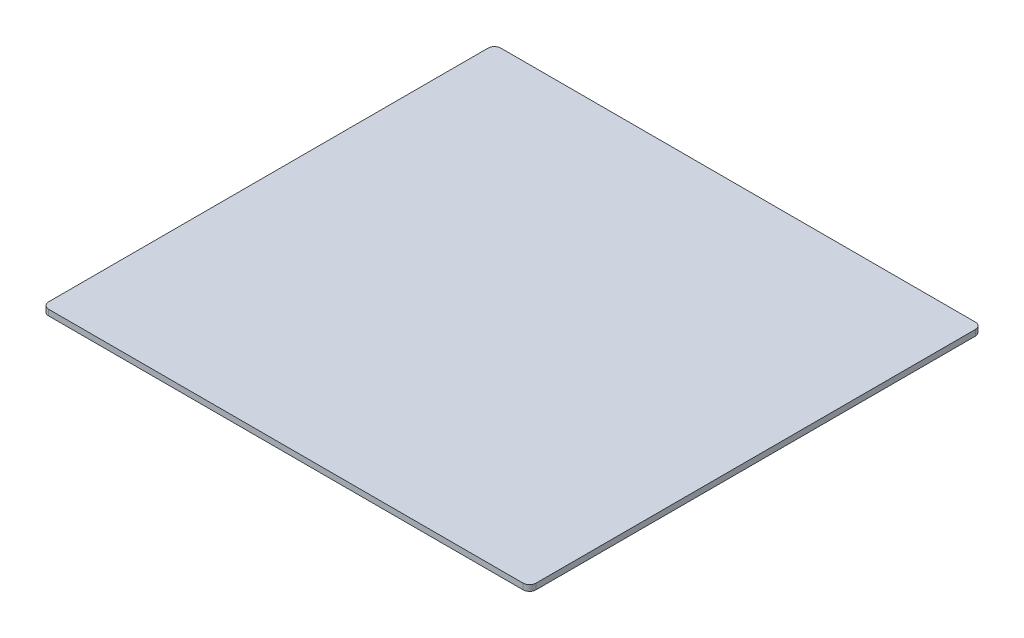
ISO-10303-21;
HEADER;
FILE_DESCRIPTION(('STEP AP214'),'2;1');
FILE_NAME('part.step','',(''),(''),'','','');
FILE_SCHEMA(('AUTOMOTIVE_DESIGN { 1 0 10303 214 1 1 1 1 }'));
ENDSEC;
DATA;
#1=APPLICATION_CONTEXT('core data for automotive mechanical design processes');
#2=APPLICATION_PROTOCOL_DEFINITION('international standard','automotive_design',2000,#1);
#3=PRODUCT_CONTEXT('',#1,'mechanical');
#4=PRODUCT('Part','Part','',(#3));
#5=PRODUCT_RELATED_PRODUCT_CATEGORY('part','',(#4));
#6=PRODUCT_DEFINITION_FORMATION('','',#4);
#7=PRODUCT_DEFINITION_CONTEXT('part definition',#1,'design');
#8=PRODUCT_DEFINITION('design','',#6,#7);
#9=PRODUCT_DEFINITION_SHAPE('','',#8);
#10=(LENGTH_UNIT() NAMED_UNIT(*) SI_UNIT(.MILLI.,.METRE.));
#11=(NAMED_UNIT(*) PLANE_ANGLE_UNIT() SI_UNIT($,.RADIAN.));
#12=(NAMED_UNIT(*) SI_UNIT($,.STERADIAN.) SOLID_ANGLE_UNIT());
#13=UNCERTAINTY_MEASURE_WITH_UNIT(LENGTH_MEASURE(1.E-05),#10,'distance_accuracy_value','');
#14=(GEOMETRIC_REPRESENTATION_CONTEXT(3) GLOBAL_UNCERTAINTY_ASSIGNED_CONTEXT((#13)) GLOBAL_UNIT_ASSIGNED_CONTEXT((#10,
#11,#12)) REPRESENTATION_CONTEXT('',''));
#15=CARTESIAN_POINT('',(0.,0.,0.));
#16=DIRECTION('',(0.,0.,1.));
#17=DIRECTION('',(1.,0.,0.));
#18=AXIS2_PLACEMENT_3D('',#15,#16,#17);
#19=CARTESIAN_POINT('',(0.,23.2,0.));
#20=DIRECTION('',(0.,-1.,0.));
#21=DIRECTION('',(0.,0.,-1.));
#22=AXIS2_PLACEMENT_3D('',#19,#20,#21);
#23=PLANE('',#22);
#24=DIRECTION('',(0.,0.,1.));
#25=VECTOR('',#24,1.);
#26=CARTESIAN_POINT('',(380.,23.2,-352.65));
#27=LINE('',#26,#25);
#28=CARTESIAN_POINT('',(380.,23.2,-342.65));
#29=VERTEX_POINT('',#28);
#30=CARTESIAN_POINT('',(380.,23.2,342.65));
#31=VERTEX_POINT('',#30);
#32=EDGE_CURVE('E464',#29,#31,#27,.T.);
#33=ORIENTED_EDGE('',*,*,#32,.F.);
#34=CARTESIAN_POINT('',(370.,23.2,-342.65));
#35=DIRECTION('',(0.,-1.,0.));
#36=DIRECTION('',(0.,0.,-1.));
#37=AXIS2_PLACEMENT_3D('',#34,#35,#36);
#38=CIRCLE('',#37,10.);
#39=CARTESIAN_POINT('',(370.,23.2,-352.65));
#40=VERTEX_POINT('',#39);
#41=EDGE_CURVE('E577',#29,#40,#38,.F.);
#42=ORIENTED_EDGE('',*,*,#41,.T.);
#43=DIRECTION('',(1.,0.,0.));
#44=VECTOR('',#43,1.);
#45=CARTESIAN_POINT('',(-380.,23.2,-352.65));
#46=LINE('',#45,#44);
#47=CARTESIAN_POINT('',(-370.,23.2,-352.65));
#48=VERTEX_POINT('',#47);
#49=EDGE_CURVE('E460',#48,#40,#46,.T.);
#50=ORIENTED_EDGE('',*,*,#49,.F.);
#51=CARTESIAN_POINT('',(-370.,23.2,-342.65));
#52=DIRECTION('',(0.,-1.,0.));
#53=DIRECTION('',(0.,0.,-1.));
#54=AXIS2_PLACEMENT_3D('',#51,#52,#53);
#55=CIRCLE('',#54,10.);
#56=CARTESIAN_POINT('',(-380.,23.2,-342.65));
#57=VERTEX_POINT('',#56);
#58=EDGE_CURVE('E568',#48,#57,#55,.F.);
#59=ORIENTED_EDGE('',*,*,#58,.T.);
#60=DIRECTION('',(0.,0.,1.));
#61=VECTOR('',#60,1.);
#62=CARTESIAN_POINT('',(-380.,23.2,-352.65));
#63=LINE('',#62,#61);
#64=CARTESIAN_POINT('',(-380.,23.2,342.65));
#65=VERTEX_POINT('',#64);
#66=EDGE_CURVE('E472',#57,#65,#63,.T.);
#67=ORIENTED_EDGE('',*,*,#66,.T.);
#68=CARTESIAN_POINT('',(-370.,23.2,342.65));
#69=DIRECTION('',(0.,-1.,0.));
#70=DIRECTION('',(0.,0.,-1.));
#71=AXIS2_PLACEMENT_3D('',#68,#69,#70);
#72=CIRCLE('',#71,10.);
#73=CARTESIAN_POINT('',(-370.,23.2,352.65));
#74=VERTEX_POINT('',#73);
#75=EDGE_CURVE('E571',#65,#74,#72,.F.);
#76=ORIENTED_EDGE('',*,*,#75,.T.);
#77=DIRECTION('',(1.,0.,0.));
#78=VECTOR('',#77,1.);
#79=CARTESIAN_POINT('',(-380.,23.2,352.65));
#80=LINE('',#79,#78);
#81=CARTESIAN_POINT('',(370.,23.2,352.65));
#82=VERTEX_POINT('',#81);
#83=EDGE_CURVE('E468',#74,#82,#80,.T.);
#84=ORIENTED_EDGE('',*,*,#83,.T.);
#85=CARTESIAN_POINT('',(370.,23.2,342.65));
#86=DIRECTION('',(0.,-1.,0.));
#87=DIRECTION('',(0.,0.,-1.));
#88=AXIS2_PLACEMENT_3D('',#85,#86,#87);
#89=CIRCLE('',#88,10.);
#90=EDGE_CURVE('E574',#82,#31,#89,.F.);
#91=ORIENTED_EDGE('',*,*,#90,.T.);
#92=EDGE_LOOP('',(#33,#42,#50,#59,#67,#76,#84,#91));
#93=FACE_BOUND('',#92,.T.);
#94=ADVANCED_FACE('F42',(#93),#23,.F.);
#95=CARTESIAN_POINT('',(-380.,23.2,-352.65));
#96=DIRECTION('',(0.,0.,-1.));
#97=DIRECTION('',(-1.,0.,0.));
#98=AXIS2_PLACEMENT_3D('',#95,#96,#97);
#99=PLANE('',#98);
#100=DIRECTION('',(0.,-1.,0.));
#101=VECTOR('',#100,1.);
#102=CARTESIAN_POINT('',(370.,23.2,-352.65));
#103=LINE('',#102,#101);
#104=CARTESIAN_POINT('',(370.,14.1,-352.65));
#105=VERTEX_POINT('',#104);
#106=EDGE_CURVE('E547',#40,#105,#103,.T.);
#107=ORIENTED_EDGE('',*,*,#106,.T.);
#108=DIRECTION('',(1.,0.,0.));
#109=VECTOR('',#108,1.);
#110=CARTESIAN_POINT('',(-380.,14.1,-352.65));
#111=LINE('',#110,#109);
#112=CARTESIAN_POINT('',(-370.,14.1,-352.65));
#113=VERTEX_POINT('',#112);
#114=EDGE_CURVE('E448',#113,#105,#111,.T.);
#115=ORIENTED_EDGE('',*,*,#114,.F.);
#116=DIRECTION('',(0.,-1.,0.));
#117=VECTOR('',#116,1.);
#118=CARTESIAN_POINT('',(-370.,23.2,-352.65));
#119=LINE('',#118,#117);
#120=EDGE_CURVE('E544',#113,#48,#119,.F.);
#121=ORIENTED_EDGE('',*,*,#120,.T.);
#122=ORIENTED_EDGE('',*,*,#49,.T.);
#123=EDGE_LOOP('',(#107,#115,#121,#122));
#124=FACE_BOUND('',#123,.T.);
#125=ADVANCED_FACE('F625',(#124),#99,.T.);
#126=CARTESIAN_POINT('',(-380.,23.2,-352.65));
#127=DIRECTION('',(1.,0.,0.));
#128=DIRECTION('',(0.,0.,-1.));
#129=AXIS2_PLACEMENT_3D('',#126,#127,#128);
#130=PLANE('',#129);
#131=DIRECTION('',(0.,-1.,0.));
#132=VECTOR('',#131,1.);
#133=CARTESIAN_POINT('',(-380.,14.1,-342.65));
#134=LINE('',#133,#132);
#135=CARTESIAN_POINT('',(-380.,14.1,-342.65));
#136=VERTEX_POINT('',#135);
#137=EDGE_CURVE('E586',#57,#136,#134,.T.);
#138=ORIENTED_EDGE('',*,*,#137,.T.);
#139=DIRECTION('',(0.,0.,-1.));
#140=VECTOR('',#139,1.);
#141=CARTESIAN_POINT('',(-380.,14.1,-352.65));
#142=LINE('',#141,#140);
#143=CARTESIAN_POINT('',(-380.,14.1,342.65));
#144=VERTEX_POINT('',#143);
#145=EDGE_CURVE('E444',#144,#136,#142,.T.);
#146=ORIENTED_EDGE('',*,*,#145,.F.);
#147=DIRECTION('',(0.,-1.,0.));
#148=VECTOR('',#147,1.);
#149=CARTESIAN_POINT('',(-380.,23.2,342.65));
#150=LINE('',#149,#148);
#151=EDGE_CURVE('E52',#144,#65,#150,.F.);
#152=ORIENTED_EDGE('',*,*,#151,.T.);
#153=ORIENTED_EDGE('',*,*,#66,.F.);
#154=EDGE_LOOP('',(#138,#146,#152,#153));
#155=FACE_BOUND('',#154,.T.);
#156=ADVANCED_FACE('F593',(#155),#130,.F.);
#157=CARTESIAN_POINT('',(-380.,23.2,352.65));
#158=DIRECTION('',(0.,0.,-1.));
#159=DIRECTION('',(-1.,0.,0.));
#160=AXIS2_PLACEMENT_3D('',#157,#158,#159);
#161=PLANE('',#160);
#162=DIRECTION('',(0.,-1.,0.));
#163=VECTOR('',#162,1.);
#164=CARTESIAN_POINT('',(-370.,23.2,352.65));
#165=LINE('',#164,#163);
#166=CARTESIAN_POINT('',(-370.,14.1,352.65));
#167=VERTEX_POINT('',#166);
#168=EDGE_CURVE('E580',#74,#167,#165,.T.);
#169=ORIENTED_EDGE('',*,*,#168,.T.);
#170=DIRECTION('',(-1.,0.,0.));
#171=VECTOR('',#170,1.);
#172=CARTESIAN_POINT('',(-380.,14.1,352.65));
#173=LINE('',#172,#171);
#174=CARTESIAN_POINT('',(370.,14.1,352.65));
#175=VERTEX_POINT('',#174);
#176=EDGE_CURVE('E456',#175,#167,#173,.T.);
#177=ORIENTED_EDGE('',*,*,#176,.F.);
#178=DIRECTION('',(0.,-1.,0.));
#179=VECTOR('',#178,1.);
#180=CARTESIAN_POINT('',(370.,23.2,352.65));
#181=LINE('',#180,#179);
#182=EDGE_CURVE('E583',#175,#82,#181,.F.);
#183=ORIENTED_EDGE('',*,*,#182,.T.);
#184=ORIENTED_EDGE('',*,*,#83,.F.);
#185=EDGE_LOOP('',(#169,#177,#183,#184));
#186=FACE_BOUND('',#185,.T.);
#187=ADVANCED_FACE('F607',(#186),#161,.F.);
#188=CARTESIAN_POINT('',(380.,23.2,-352.65));
#189=DIRECTION('',(1.,0.,0.));
#190=DIRECTION('',(0.,0.,-1.));
#191=AXIS2_PLACEMENT_3D('',#188,#189,#190);
#192=PLANE('',#191);
#193=DIRECTION('',(0.,-1.,0.));
#194=VECTOR('',#193,1.);
#195=CARTESIAN_POINT('',(380.,14.1,342.65));
#196=LINE('',#195,#194);
#197=CARTESIAN_POINT('',(380.,14.1,342.65));
#198=VERTEX_POINT('',#197);
#199=EDGE_CURVE('E562',#31,#198,#196,.T.);
#200=ORIENTED_EDGE('',*,*,#199,.T.);
#201=DIRECTION('',(0.,0.,1.));
#202=VECTOR('',#201,1.);
#203=CARTESIAN_POINT('',(380.,14.1,-352.65));
#204=LINE('',#203,#202);
#205=CARTESIAN_POINT('',(380.,14.1,-342.65));
#206=VERTEX_POINT('',#205);
#207=EDGE_CURVE('E452',#206,#198,#204,.T.);
#208=ORIENTED_EDGE('',*,*,#207,.F.);
#209=DIRECTION('',(0.,-1.,0.));
#210=VECTOR('',#209,1.);
#211=CARTESIAN_POINT('',(380.,23.2,-342.65));
#212=LINE('',#211,#210);
#213=EDGE_CURVE('E565',#206,#29,#212,.F.);
#214=ORIENTED_EDGE('',*,*,#213,.T.);
#215=ORIENTED_EDGE('',*,*,#32,.T.);
#216=EDGE_LOOP('',(#200,#208,#214,#215));
#217=FACE_BOUND('',#216,.T.);
#218=ADVANCED_FACE('F616',(#217),#192,.T.);
#219=CARTESIAN_POINT('',(0.,14.1,0.));
#220=DIRECTION('',(0.,1.,0.));
#221=DIRECTION('',(0.,0.,1.));
#222=AXIS2_PLACEMENT_3D('',#219,#220,#221);
#223=PLANE('',#222);
#224=DIRECTION('',(-1.,0.,0.));
#225=VECTOR('',#224,1.);
#226=CARTESIAN_POINT('',(0.,14.1,-315.75));
#227=LINE('',#226,#225);
#228=CARTESIAN_POINT('',(223.177282085676,14.1,-315.75));
#229=VERTEX_POINT('',#228);
#230=CARTESIAN_POINT('',(-223.177282085676,14.1,-315.75));
#231=VERTEX_POINT('',#230);
#232=EDGE_CURVE('E480',#229,#231,#227,.T.);
#233=ORIENTED_EDGE('',*,*,#232,.T.);
#234=CARTESIAN_POINT('',(-218.627660484725,14.1,-300.277660484725));
#235=DIRECTION('',(0.,1.,0.));
#236=DIRECTION('',(0.707106781186549,0.,0.707106781186546));
#237=AXIS2_PLACEMENT_3D('',#234,#235,#236);
#238=ELLIPSE('',#237,17.6007551017536,13.);
#239=CARTESIAN_POINT('',(-234.1,14.1,-304.827282085676));
#240=VERTEX_POINT('',#239);
#241=EDGE_CURVE('E532',#231,#240,#238,.T.);
#242=ORIENTED_EDGE('',*,*,#241,.T.);
#243=DIRECTION('',(0.,0.,1.));
#244=VECTOR('',#243,1.);
#245=CARTESIAN_POINT('',(-234.1,14.1,0.));
#246=LINE('',#245,#244);
#247=CARTESIAN_POINT('',(-234.1,14.1,304.827282085676));
#248=VERTEX_POINT('',#247);
#249=EDGE_CURVE('E476',#240,#248,#246,.T.);
#250=ORIENTED_EDGE('',*,*,#249,.T.);
#251=CARTESIAN_POINT('',(-218.627660484725,14.1,300.277660484725));
#252=DIRECTION('',(0.,1.,0.));
#253=DIRECTION('',(0.707106781186549,0.,-0.707106781186546));
#254=AXIS2_PLACEMENT_3D('',#251,#252,#253);
#255=ELLIPSE('',#254,17.6007551017536,13.);
#256=CARTESIAN_POINT('',(-223.177282085676,14.1,315.75));
#257=VERTEX_POINT('',#256);
#258=EDGE_CURVE('E535',#248,#257,#255,.T.);
#259=ORIENTED_EDGE('',*,*,#258,.T.);
#260=DIRECTION('',(1.,0.,0.));
#261=VECTOR('',#260,1.);
#262=CARTESIAN_POINT('',(0.,14.1,315.75));
#263=LINE('',#262,#261);
#264=CARTESIAN_POINT('',(223.177282085676,14.1,315.75));
#265=VERTEX_POINT('',#264);
#266=EDGE_CURVE('E488',#257,#265,#263,.T.);
#267=ORIENTED_EDGE('',*,*,#266,.T.);
#268=CARTESIAN_POINT('',(218.627660484725,14.1,300.277660484725));
#269=DIRECTION('',(0.,1.,0.));
#270=DIRECTION('',(0.707106781186548,0.,0.707106781186548));
#271=AXIS2_PLACEMENT_3D('',#268,#269,#270);
#272=ELLIPSE('',#271,17.6007551017536,13.);
#273=CARTESIAN_POINT('',(234.1,14.1,304.827282085676));
#274=VERTEX_POINT('',#273);
#275=EDGE_CURVE('E538',#265,#274,#272,.T.);
#276=ORIENTED_EDGE('',*,*,#275,.T.);
#277=DIRECTION('',(0.,0.,-1.));
#278=VECTOR('',#277,1.);
#279=CARTESIAN_POINT('',(234.1,14.1,0.));
#280=LINE('',#279,#278);
#281=CARTESIAN_POINT('',(234.1,14.1,-304.827282085676));
#282=VERTEX_POINT('',#281);
#283=EDGE_CURVE('E484',#274,#282,#280,.T.);
#284=ORIENTED_EDGE('',*,*,#283,.T.);
#285=CARTESIAN_POINT('',(218.627660484725,14.1,-300.277660484725));
#286=DIRECTION('',(0.,1.,0.));
#287=DIRECTION('',(0.707106781186548,0.,-0.707106781186548));
#288=AXIS2_PLACEMENT_3D('',#285,#286,#287);
#289=ELLIPSE('',#288,17.6007551017536,13.);
#290=EDGE_CURVE('E541',#282,#229,#289,.T.);
#291=ORIENTED_EDGE('',*,*,#290,.T.);
#292=EDGE_LOOP('',(#233,#242,#250,#259,#267,#276,#284,#291));
#293=FACE_BOUND('',#292,.T.);
#294=ORIENTED_EDGE('',*,*,#114,.T.);
#295=CARTESIAN_POINT('',(370.,14.1,-342.65));
#296=DIRECTION('',(0.,1.,0.));
#297=DIRECTION('',(0.,0.,1.));
#298=AXIS2_PLACEMENT_3D('',#295,#296,#297);
#299=CIRCLE('',#298,10.);
#300=EDGE_CURVE('E559',#105,#206,#299,.F.);
#301=ORIENTED_EDGE('',*,*,#300,.T.);
#302=ORIENTED_EDGE('',*,*,#207,.T.);
#303=CARTESIAN_POINT('',(370.,14.1,342.65));
#304=DIRECTION('',(0.,1.,0.));
#305=DIRECTION('',(0.,0.,1.));
#306=AXIS2_PLACEMENT_3D('',#303,#304,#305);
#307=CIRCLE('',#306,10.);
#308=EDGE_CURVE('E556',#198,#175,#307,.F.);
#309=ORIENTED_EDGE('',*,*,#308,.T.);
#310=ORIENTED_EDGE('',*,*,#176,.T.);
#311=CARTESIAN_POINT('',(-370.,14.1,342.65));
#312=DIRECTION('',(0.,1.,0.));
#313=DIRECTION('',(0.,0.,1.));
#314=AXIS2_PLACEMENT_3D('',#311,#312,#313);
#315=CIRCLE('',#314,10.);
#316=EDGE_CURVE('E553',#167,#144,#315,.F.);
#317=ORIENTED_EDGE('',*,*,#316,.T.);
#318=ORIENTED_EDGE('',*,*,#145,.T.);
#319=CARTESIAN_POINT('',(-370.,14.1,-342.65));
#320=DIRECTION('',(0.,1.,0.));
#321=DIRECTION('',(0.,0.,1.));
#322=AXIS2_PLACEMENT_3D('',#319,#320,#321);
#323=CIRCLE('',#322,10.);
#324=EDGE_CURVE('E550',#136,#113,#323,.F.);
#325=ORIENTED_EDGE('',*,*,#324,.T.);
#326=EDGE_LOOP('',(#294,#301,#302,#309,#310,#317,#318,#325));
#327=FACE_BOUND('',#326,.T.);
#328=ADVANCED_FACE('F630',(#293,#327),#223,.F.);
#329=CARTESIAN_POINT('',(0.,0.,0.));
#330=DIRECTION('',(0.,-1.,0.));
#331=DIRECTION('',(0.,0.,-1.));
#332=AXIS2_PLACEMENT_3D('',#329,#330,#331);
#333=PLANE('',#332);
#334=DIRECTION('',(0.,0.,-1.));
#335=VECTOR('',#334,1.);
#336=CARTESIAN_POINT('',(-225.,0.,306.65));
#337=LINE('',#336,#335);
#338=CARTESIAN_POINT('',(-225.,0.,295.727282085676));
#339=VERTEX_POINT('',#338);
#340=CARTESIAN_POINT('',(-225.,0.,-295.727282085676));
#341=VERTEX_POINT('',#340);
#342=EDGE_CURVE('E361',#339,#341,#337,.T.);
#343=ORIENTED_EDGE('',*,*,#342,.T.);
#344=CARTESIAN_POINT('',(-209.527660484725,0.,-291.177660484725));
#345=DIRECTION('',(0.,-1.,0.));
#346=DIRECTION('',(0.707106781186549,0.,0.707106781186546));
#347=AXIS2_PLACEMENT_3D('',#344,#345,#346);
#348=ELLIPSE('',#347,17.6007551017536,13.);
#349=CARTESIAN_POINT('',(-214.077282085676,0.,-306.65));
#350=VERTEX_POINT('',#349);
#351=EDGE_CURVE('E508',#341,#350,#348,.T.);
#352=ORIENTED_EDGE('',*,*,#351,.T.);
#353=DIRECTION('',(1.,0.,0.));
#354=VECTOR('',#353,1.);
#355=CARTESIAN_POINT('',(-225.,0.,-306.65));
#356=LINE('',#355,#354);
#357=CARTESIAN_POINT('',(214.077282085676,0.,-306.65));
#358=VERTEX_POINT('',#357);
#359=EDGE_CURVE('E432',#350,#358,#356,.T.);
#360=ORIENTED_EDGE('',*,*,#359,.T.);
#361=CARTESIAN_POINT('',(209.527660484725,0.,-291.177660484725));
#362=DIRECTION('',(0.,-1.,0.));
#363=DIRECTION('',(0.707106781186548,0.,-0.707106781186548));
#364=AXIS2_PLACEMENT_3D('',#361,#362,#363);
#365=ELLIPSE('',#364,17.6007551017536,13.);
#366=CARTESIAN_POINT('',(225.,0.,-295.727282085676));
#367=VERTEX_POINT('',#366);
#368=EDGE_CURVE('E499',#358,#367,#365,.T.);
#369=ORIENTED_EDGE('',*,*,#368,.T.);
#370=DIRECTION('',(0.,0.,1.));
#371=VECTOR('',#370,1.);
#372=CARTESIAN_POINT('',(225.,0.,306.65));
#373=LINE('',#372,#371);
#374=CARTESIAN_POINT('',(225.,0.,295.727282085676));
#375=VERTEX_POINT('',#374);
#376=EDGE_CURVE('E436',#367,#375,#373,.T.);
#377=ORIENTED_EDGE('',*,*,#376,.T.);
#378=CARTESIAN_POINT('',(209.527660484725,0.,291.177660484725));
#379=DIRECTION('',(0.,-1.,0.));
#380=DIRECTION('',(0.707106781186548,0.,0.707106781186548));
#381=AXIS2_PLACEMENT_3D('',#378,#379,#380);
#382=ELLIPSE('',#381,17.6007551017536,13.);
#383=CARTESIAN_POINT('',(214.077282085676,0.,306.65));
#384=VERTEX_POINT('',#383);
#385=EDGE_CURVE('E502',#375,#384,#382,.T.);
#386=ORIENTED_EDGE('',*,*,#385,.T.);
#387=DIRECTION('',(-1.,0.,0.));
#388=VECTOR('',#387,1.);
#389=CARTESIAN_POINT('',(-225.,0.,306.65));
#390=LINE('',#389,#388);
#391=CARTESIAN_POINT('',(-214.077282085676,0.,306.65));
#392=VERTEX_POINT('',#391);
#393=EDGE_CURVE('E440',#384,#392,#390,.T.);
#394=ORIENTED_EDGE('',*,*,#393,.T.);
#395=CARTESIAN_POINT('',(-209.527660484725,0.,291.177660484725));
#396=DIRECTION('',(0.,-1.,0.));
#397=DIRECTION('',(0.707106781186549,0.,-0.707106781186546));
#398=AXIS2_PLACEMENT_3D('',#395,#396,#397);
#399=ELLIPSE('',#398,17.6007551017536,13.);
#400=EDGE_CURVE('E505',#392,#339,#399,.T.);
#401=ORIENTED_EDGE('',*,*,#400,.T.);
#402=EDGE_LOOP('',(#343,#352,#360,#369,#377,#386,#394,#401));
#403=FACE_BOUND('',#402,.T.);
#404=ADVANCED_FACE('F632',(#403),#333,.T.);
#405=CARTESIAN_POINT('',(-225.,0.,-306.65));
#406=DIRECTION('',(0.,0.542262591491257,0.840209070332608));
#407=DIRECTION('',(1.,0.,0.));
#408=AXIS2_PLACEMENT_3D('',#405,#406,#407);
#409=PLANE('',#408);
#410=ORIENTED_EDGE('',*,*,#359,.F.);
#411=DIRECTION('',(0.476688123519766,-0.738604674904249,0.476688123519763));
#412=VECTOR('',#411,1.);
#413=CARTESIAN_POINT('',(-216.559268394392,3.84571504976785,-309.131986308715));
#414=LINE('',#413,#412);
#415=EDGE_CURVE('E514',#350,#231,#414,.F.);
#416=ORIENTED_EDGE('',*,*,#415,.T.);
#417=ORIENTED_EDGE('',*,*,#232,.F.);
#418=DIRECTION('',(0.476688123519764,0.73860467490425,-0.476688123519764));
#419=VECTOR('',#418,1.);
#420=CARTESIAN_POINT('',(114.305063197235,-154.592119376597,-206.877781111558));
#421=LINE('',#420,#419);
#422=EDGE_CURVE('E511',#229,#358,#421,.F.);
#423=ORIENTED_EDGE('',*,*,#422,.T.);
#424=EDGE_LOOP('',(#410,#416,#417,#423));
#425=FACE_BOUND('',#424,.T.);
#426=ADVANCED_FACE('F639',(#425),#409,.F.);
#427=CARTESIAN_POINT('',(225.,0.,306.65));
#428=DIRECTION('',(-0.840209070332608,0.542262591491257,0.));
#429=DIRECTION('',(0.,0.,1.));
#430=AXIS2_PLACEMENT_3D('',#427,#428,#429);
#431=PLANE('',#430);
#432=ORIENTED_EDGE('',*,*,#283,.F.);
#433=DIRECTION('',(0.476688123519764,0.73860467490425,0.476688123519764));
#434=VECTOR('',#433,1.);
#435=CARTESIAN_POINT('',(227.481986308716,3.84571504976787,298.209268394392));
#436=LINE('',#435,#434);
#437=EDGE_CURVE('E529',#274,#375,#436,.F.);
#438=ORIENTED_EDGE('',*,*,#437,.T.);
#439=ORIENTED_EDGE('',*,*,#376,.F.);
#440=DIRECTION('',(0.476688123519764,0.73860467490425,-0.476688123519764));
#441=VECTOR('',#440,1.);
#442=CARTESIAN_POINT('',(88.1208662033456,-212.087449069542,-158.848148289022));
#443=LINE('',#442,#441);
#444=EDGE_CURVE('E525',#367,#282,#443,.T.);
#445=ORIENTED_EDGE('',*,*,#444,.T.);
#446=EDGE_LOOP('',(#432,#438,#439,#445));
#447=FACE_BOUND('',#446,.T.);
#448=ADVANCED_FACE('F670',(#447),#431,.F.);
#449=CARTESIAN_POINT('',(-225.,0.,306.65));
#450=DIRECTION('',(0.840209070332607,0.542262591491259,0.));
#451=DIRECTION('',(0.,0.,-1.));
#452=AXIS2_PLACEMENT_3D('',#449,#450,#451);
#453=PLANE('',#452);
#454=ORIENTED_EDGE('',*,*,#249,.F.);
#455=DIRECTION('',(0.476688123519766,-0.738604674904249,0.476688123519763));
#456=VECTOR('',#455,1.);
#457=CARTESIAN_POINT('',(-88.1208662033451,-212.087449069541,-158.848148289022));
#458=LINE('',#457,#456);
#459=EDGE_CURVE('E495',#240,#341,#458,.T.);
#460=ORIENTED_EDGE('',*,*,#459,.T.);
#461=ORIENTED_EDGE('',*,*,#342,.F.);
#462=DIRECTION('',(0.476688123519766,-0.738604674904249,-0.476688123519763));
#463=VECTOR('',#462,1.);
#464=CARTESIAN_POINT('',(-227.481986308716,3.84571504976784,298.209268394392));
#465=LINE('',#464,#463);
#466=EDGE_CURVE('E492',#339,#248,#465,.F.);
#467=ORIENTED_EDGE('',*,*,#466,.T.);
#468=EDGE_LOOP('',(#454,#460,#461,#467));
#469=FACE_BOUND('',#468,.T.);
#470=ADVANCED_FACE('F663',(#469),#453,.F.);
#471=CARTESIAN_POINT('',(-225.,0.,306.65));
#472=DIRECTION('',(0.,0.542262591491257,-0.840209070332608));
#473=DIRECTION('',(-1.,0.,0.));
#474=AXIS2_PLACEMENT_3D('',#471,#472,#473);
#475=PLANE('',#474);
#476=ORIENTED_EDGE('',*,*,#266,.F.);
#477=DIRECTION('',(0.476688123519766,-0.738604674904249,-0.476688123519763));
#478=VECTOR('',#477,1.);
#479=CARTESIAN_POINT('',(-216.559268394392,3.84571504976786,309.131986308715));
#480=LINE('',#479,#478);
#481=EDGE_CURVE('E521',#257,#392,#480,.T.);
#482=ORIENTED_EDGE('',*,*,#481,.T.);
#483=ORIENTED_EDGE('',*,*,#393,.F.);
#484=DIRECTION('',(0.476688123519764,0.73860467490425,0.476688123519764));
#485=VECTOR('',#484,1.);
#486=CARTESIAN_POINT('',(114.305063197234,-154.592119376597,206.877781111558));
#487=LINE('',#486,#485);
#488=EDGE_CURVE('E517',#384,#265,#487,.T.);
#489=ORIENTED_EDGE('',*,*,#488,.T.);
#490=EDGE_LOOP('',(#476,#482,#483,#489));
#491=FACE_BOUND('',#490,.T.);
#492=ADVANCED_FACE('F656',(#491),#475,.F.);
#493=CARTESIAN_POINT('',(-77.1981482890213,-205.038035380155,-158.848148289022));
#494=DIRECTION('',(0.476688123519766,-0.738604674904249,0.476688123519763));
#495=DIRECTION('',(0.840209070332607,0.542262591491259,0.));
#496=AXIS2_PLACEMENT_3D('',#493,#494,#495);
#497=CYLINDRICAL_SURFACE('',#496,13.);
#498=ORIENTED_EDGE('',*,*,#241,.F.);
#499=ORIENTED_EDGE('',*,*,#415,.F.);
#500=ORIENTED_EDGE('',*,*,#351,.F.);
#501=ORIENTED_EDGE('',*,*,#459,.F.);
#502=EDGE_LOOP('',(#498,#499,#500,#501));
#503=FACE_BOUND('',#502,.T.);
#504=ADVANCED_FACE('F662',(#503),#497,.T.);
#505=CARTESIAN_POINT('',(-216.559268394392,10.8951287391542,298.209268394392));
#506=DIRECTION('',(0.476688123519766,-0.738604674904249,-0.476688123519763));
#507=DIRECTION('',(0.840209070332607,0.542262591491259,0.));
#508=AXIS2_PLACEMENT_3D('',#505,#506,#507);
#509=CYLINDRICAL_SURFACE('',#508,13.);
#510=ORIENTED_EDGE('',*,*,#258,.F.);
#511=ORIENTED_EDGE('',*,*,#466,.F.);
#512=ORIENTED_EDGE('',*,*,#400,.F.);
#513=ORIENTED_EDGE('',*,*,#481,.F.);
#514=EDGE_LOOP('',(#510,#511,#512,#513));
#515=FACE_BOUND('',#514,.T.);
#516=ADVANCED_FACE('F685',(#515),#509,.T.);
#517=CARTESIAN_POINT('',(114.305063197234,-147.54270568721,195.955063197234));
#518=DIRECTION('',(0.476688123519764,0.73860467490425,0.476688123519764));
#519=DIRECTION('',(0.,-0.542262591491258,0.840209070332608));
#520=AXIS2_PLACEMENT_3D('',#517,#518,#519);
#521=CYLINDRICAL_SURFACE('',#520,13.);
#522=ORIENTED_EDGE('',*,*,#385,.F.);
#523=ORIENTED_EDGE('',*,*,#437,.F.);
#524=ORIENTED_EDGE('',*,*,#275,.F.);
#525=ORIENTED_EDGE('',*,*,#488,.F.);
#526=EDGE_LOOP('',(#522,#523,#524,#525));
#527=FACE_BOUND('',#526,.T.);
#528=ADVANCED_FACE('F689',(#527),#521,.T.);
#529=CARTESIAN_POINT('',(77.1981482890217,-205.038035380155,-158.848148289022));
#530=DIRECTION('',(0.476688123519764,0.73860467490425,-0.476688123519764));
#531=DIRECTION('',(0.,0.542262591491258,0.840209070332608));
#532=AXIS2_PLACEMENT_3D('',#529,#530,#531);
#533=CYLINDRICAL_SURFACE('',#532,13.);
#534=ORIENTED_EDGE('',*,*,#368,.F.);
#535=ORIENTED_EDGE('',*,*,#422,.F.);
#536=ORIENTED_EDGE('',*,*,#290,.F.);
#537=ORIENTED_EDGE('',*,*,#444,.F.);
#538=EDGE_LOOP('',(#534,#535,#536,#537));
#539=FACE_BOUND('',#538,.T.);
#540=ADVANCED_FACE('F693',(#539),#533,.T.);
#541=CARTESIAN_POINT('',(370.,23.2,-342.65));
#542=DIRECTION('',(0.,-1.,0.));
#543=DIRECTION('',(0.,0.,-1.));
#544=AXIS2_PLACEMENT_3D('',#541,#542,#543);
#545=CYLINDRICAL_SURFACE('',#544,10.);
#546=ORIENTED_EDGE('',*,*,#41,.F.);
#547=ORIENTED_EDGE('',*,*,#213,.F.);
#548=ORIENTED_EDGE('',*,*,#300,.F.);
#549=ORIENTED_EDGE('',*,*,#106,.F.);
#550=EDGE_LOOP('',(#546,#547,#548,#549));
#551=FACE_BOUND('',#550,.T.);
#552=ADVANCED_FACE('F621',(#551),#545,.T.);
#553=CARTESIAN_POINT('',(370.,23.2,342.65));
#554=DIRECTION('',(0.,1.,0.));
#555=DIRECTION('',(0.,0.,1.));
#556=AXIS2_PLACEMENT_3D('',#553,#554,#555);
#557=CYLINDRICAL_SURFACE('',#556,10.);
#558=ORIENTED_EDGE('',*,*,#90,.F.);
#559=ORIENTED_EDGE('',*,*,#182,.F.);
#560=ORIENTED_EDGE('',*,*,#308,.F.);
#561=ORIENTED_EDGE('',*,*,#199,.F.);
#562=EDGE_LOOP('',(#558,#559,#560,#561));
#563=FACE_BOUND('',#562,.T.);
#564=ADVANCED_FACE('F612',(#563),#557,.T.);
#565=CARTESIAN_POINT('',(-370.,23.2,342.65));
#566=DIRECTION('',(0.,-1.,0.));
#567=DIRECTION('',(0.,0.,-1.));
#568=AXIS2_PLACEMENT_3D('',#565,#566,#567);
#569=CYLINDRICAL_SURFACE('',#568,10.);
#570=ORIENTED_EDGE('',*,*,#75,.F.);
#571=ORIENTED_EDGE('',*,*,#151,.F.);
#572=ORIENTED_EDGE('',*,*,#316,.F.);
#573=ORIENTED_EDGE('',*,*,#168,.F.);
#574=EDGE_LOOP('',(#570,#571,#572,#573));
#575=FACE_BOUND('',#574,.T.);
#576=ADVANCED_FACE('F604',(#575),#569,.T.);
#577=CARTESIAN_POINT('',(-370.,23.2,-342.65));
#578=DIRECTION('',(0.,1.,0.));
#579=DIRECTION('',(0.,0.,1.));
#580=AXIS2_PLACEMENT_3D('',#577,#578,#579);
#581=CYLINDRICAL_SURFACE('',#580,10.);
#582=ORIENTED_EDGE('',*,*,#58,.F.);
#583=ORIENTED_EDGE('',*,*,#120,.F.);
#584=ORIENTED_EDGE('',*,*,#324,.F.);
#585=ORIENTED_EDGE('',*,*,#137,.F.);
#586=EDGE_LOOP('',(#582,#583,#584,#585));
#587=FACE_BOUND('',#586,.T.);
#588=ADVANCED_FACE('F44',(#587),#581,.T.);
#589=CLOSED_SHELL('',(#94,#125,#156,#187,#218,#328,#404,#426,#448,#470,#492,#504,#516,#528,#540,
#552,#564,#576,#588));
#590=CARTESIAN_POINT('',(-370.,22.2,-342.65));
#591=DIRECTION('',(0.,1.,0.));
#592=DIRECTION('',(0.,0.,1.));
#593=AXIS2_PLACEMENT_3D('',#590,#591,#592);
#594=PLANE('',#593);
#595=DIRECTION('',(0.,0.,1.));
#596=VECTOR('',#595,1.);
#597=CARTESIAN_POINT('',(379.,22.2,-352.65));
#598=LINE('',#597,#596);
#599=CARTESIAN_POINT('',(379.,22.2,-342.65));
#600=VERTEX_POINT('',#599);
#601=CARTESIAN_POINT('',(379.,22.2,342.65));
#602=VERTEX_POINT('',#601);
#603=EDGE_CURVE('E59',#600,#602,#598,.T.);
#604=ORIENTED_EDGE('',*,*,#603,.T.);
#605=CARTESIAN_POINT('',(370.,22.2,342.65));
#606=DIRECTION('',(0.,1.,0.));
#607=DIRECTION('',(0.,0.,1.));
#608=AXIS2_PLACEMENT_3D('',#605,#606,#607);
#609=CIRCLE('',#608,9.);
#610=CARTESIAN_POINT('',(370.,22.2,351.65));
#611=VERTEX_POINT('',#610);
#612=EDGE_CURVE('E294',#602,#611,#609,.F.);
#613=ORIENTED_EDGE('',*,*,#612,.T.);
#614=DIRECTION('',(1.,0.,0.));
#615=VECTOR('',#614,1.);
#616=CARTESIAN_POINT('',(-380.,22.2,351.65));
#617=LINE('',#616,#615);
#618=CARTESIAN_POINT('',(-370.,22.2,351.65));
#619=VERTEX_POINT('',#618);
#620=EDGE_CURVE('E291',#619,#611,#617,.T.);
#621=ORIENTED_EDGE('',*,*,#620,.F.);
#622=CARTESIAN_POINT('',(-370.,22.2,342.65));
#623=DIRECTION('',(0.,1.,0.));
#624=DIRECTION('',(0.,0.,1.));
#625=AXIS2_PLACEMENT_3D('',#622,#623,#624);
#626=CIRCLE('',#625,9.);
#627=CARTESIAN_POINT('',(-379.,22.2,342.65));
#628=VERTEX_POINT('',#627);
#629=EDGE_CURVE('E272',#619,#628,#626,.F.);
#630=ORIENTED_EDGE('',*,*,#629,.T.);
#631=DIRECTION('',(0.,0.,1.));
#632=VECTOR('',#631,1.);
#633=CARTESIAN_POINT('',(-379.,22.2,-352.65));
#634=LINE('',#633,#632);
#635=CARTESIAN_POINT('',(-379.,22.2,-342.65));
#636=VERTEX_POINT('',#635);
#637=EDGE_CURVE('E273',#636,#628,#634,.T.);
#638=ORIENTED_EDGE('',*,*,#637,.F.);
#639=CARTESIAN_POINT('',(-370.,22.2,-342.65));
#640=DIRECTION('',(0.,1.,0.));
#641=DIRECTION('',(0.,0.,1.));
#642=AXIS2_PLACEMENT_3D('',#639,#640,#641);
#643=CIRCLE('',#642,9.);
#644=CARTESIAN_POINT('',(-370.,22.2,-351.65));
#645=VERTEX_POINT('',#644);
#646=EDGE_CURVE('E11',#636,#645,#643,.F.);
#647=ORIENTED_EDGE('',*,*,#646,.T.);
#648=DIRECTION('',(1.,0.,0.));
#649=VECTOR('',#648,1.);
#650=CARTESIAN_POINT('',(-380.,22.2,-351.65));
#651=LINE('',#650,#649);
#652=CARTESIAN_POINT('',(370.,22.2,-351.65));
#653=VERTEX_POINT('',#652);
#654=EDGE_CURVE('E268',#645,#653,#651,.T.);
#655=ORIENTED_EDGE('',*,*,#654,.T.);
#656=CARTESIAN_POINT('',(370.,22.2,-342.65));
#657=DIRECTION('',(0.,1.,0.));
#658=DIRECTION('',(0.,0.,1.));
#659=AXIS2_PLACEMENT_3D('',#656,#657,#658);
#660=CIRCLE('',#659,9.);
#661=EDGE_CURVE('E66',#653,#600,#660,.F.);
#662=ORIENTED_EDGE('',*,*,#661,.T.);
#663=EDGE_LOOP('',(#604,#613,#621,#630,#638,#647,#655,#662));
#664=FACE_BOUND('',#663,.T.);
#665=ADVANCED_FACE('F276',(#664),#594,.F.);
#666=CARTESIAN_POINT('',(0.,1.,0.));
#667=DIRECTION('',(0.,-1.,0.));
#668=DIRECTION('',(0.,0.,-1.));
#669=AXIS2_PLACEMENT_3D('',#666,#667,#668);
#670=PLANE('',#669);
#671=DIRECTION('',(0.,0.,-1.));
#672=VECTOR('',#671,1.);
#673=CARTESIAN_POINT('',(-224.455210108209,1.,306.65));
#674=LINE('',#673,#672);
#675=CARTESIAN_POINT('',(-224.455210108209,1.,296.022701264217));
#676=VERTEX_POINT('',#675);
#677=CARTESIAN_POINT('',(-224.455210108209,0.999999999999973,-296.022701264217));
#678=VERTEX_POINT('',#677);
#679=EDGE_CURVE('E298',#676,#678,#674,.T.);
#680=ORIENTED_EDGE('',*,*,#679,.F.);
#681=CARTESIAN_POINT('',(-210.173050555647,1.,291.823050555647));
#682=DIRECTION('',(0.,-1.,0.));
#683=DIRECTION('',(0.707106781186549,0.,-0.707106781186546));
#684=AXIS2_PLACEMENT_3D('',#681,#682,#683);
#685=ELLIPSE('',#684,16.2468508631571,12.);
#686=CARTESIAN_POINT('',(-214.372701264217,1.,306.105210108208));
#687=VERTEX_POINT('',#686);
#688=EDGE_CURVE('E395',#687,#676,#685,.T.);
#689=ORIENTED_EDGE('',*,*,#688,.F.);
#690=DIRECTION('',(-1.,0.,0.));
#691=VECTOR('',#690,1.);
#692=CARTESIAN_POINT('',(-225.,1.,306.105210108208));
#693=LINE('',#692,#691);
#694=CARTESIAN_POINT('',(214.372701264217,1.,306.105210108208));
#695=VERTEX_POINT('',#694);
#696=EDGE_CURVE('E355',#695,#687,#693,.T.);
#697=ORIENTED_EDGE('',*,*,#696,.F.);
#698=CARTESIAN_POINT('',(210.173050555647,1.,291.823050555647));
#699=DIRECTION('',(0.,-1.,0.));
#700=DIRECTION('',(0.707106781186548,0.,0.707106781186548));
#701=AXIS2_PLACEMENT_3D('',#698,#699,#700);
#702=ELLIPSE('',#701,16.2468508631571,12.);
#703=CARTESIAN_POINT('',(224.455210108209,1.,296.022701264217));
#704=VERTEX_POINT('',#703);
#705=EDGE_CURVE('E399',#704,#695,#702,.T.);
#706=ORIENTED_EDGE('',*,*,#705,.F.);
#707=DIRECTION('',(0.,0.,1.));
#708=VECTOR('',#707,1.);
#709=CARTESIAN_POINT('',(224.455210108209,1.,306.65));
#710=LINE('',#709,#708);
#711=CARTESIAN_POINT('',(224.455210108209,1.,-296.022701264217));
#712=VERTEX_POINT('',#711);
#713=EDGE_CURVE('E381',#712,#704,#710,.T.);
#714=ORIENTED_EDGE('',*,*,#713,.F.);
#715=CARTESIAN_POINT('',(210.173050555647,1.,-291.823050555646));
#716=DIRECTION('',(0.,-1.,0.));
#717=DIRECTION('',(0.707106781186548,0.,-0.707106781186548));
#718=AXIS2_PLACEMENT_3D('',#715,#716,#717);
#719=ELLIPSE('',#718,16.2468508631571,12.);
#720=CARTESIAN_POINT('',(214.372701264217,1.00000000000003,-306.105210108208));
#721=VERTEX_POINT('',#720);
#722=EDGE_CURVE('E396',#721,#712,#719,.T.);
#723=ORIENTED_EDGE('',*,*,#722,.F.);
#724=DIRECTION('',(1.,0.,0.));
#725=VECTOR('',#724,1.);
#726=CARTESIAN_POINT('',(-225.,1.,-306.105210108208));
#727=LINE('',#726,#725);
#728=CARTESIAN_POINT('',(-214.372701264217,0.999999999999973,-306.105210108208));
#729=VERTEX_POINT('',#728);
#730=EDGE_CURVE('E377',#729,#721,#727,.T.);
#731=ORIENTED_EDGE('',*,*,#730,.F.);
#732=CARTESIAN_POINT('',(-210.173050555647,1.00000000000003,-291.823050555647));
#733=DIRECTION('',(0.,-1.,0.));
#734=DIRECTION('',(0.707106781186549,0.,0.707106781186546));
#735=AXIS2_PLACEMENT_3D('',#732,#733,#734);
#736=ELLIPSE('',#735,16.2468508631571,12.);
#737=EDGE_CURVE('E389',#678,#729,#736,.T.);
#738=ORIENTED_EDGE('',*,*,#737,.F.);
#739=EDGE_LOOP('',(#680,#689,#697,#706,#714,#723,#731,#738));
#740=FACE_BOUND('',#739,.T.);
#741=ADVANCED_FACE('F713',(#740),#670,.F.);
#742=CARTESIAN_POINT('',(-77.1981482890213,-205.038035380155,-158.848148289022));
#743=DIRECTION('',(0.476688123519766,-0.738604674904249,0.476688123519763));
#744=DIRECTION('',(0.840209070332607,0.542262591491259,0.));
#745=AXIS2_PLACEMENT_3D('',#742,#743,#744);
#746=CYLINDRICAL_SURFACE('',#745,12.);
#747=CARTESIAN_POINT('',(-219.273050555647,15.1,-300.923050555647));
#748=DIRECTION('',(0.,1.,0.));
#749=DIRECTION('',(0.707106781186549,0.,0.707106781186546));
#750=AXIS2_PLACEMENT_3D('',#747,#748,#749);
#751=ELLIPSE('',#750,16.2468508631571,12.);
#752=CARTESIAN_POINT('',(-223.472701264217,15.1,-315.205210108208));
#753=VERTEX_POINT('',#752);
#754=CARTESIAN_POINT('',(-233.555210108209,15.1,-305.122701264217));
#755=VERTEX_POINT('',#754);
#756=EDGE_CURVE('E312',#753,#755,#751,.T.);
#757=ORIENTED_EDGE('',*,*,#756,.T.);
#758=DIRECTION('',(0.476688123519766,-0.738604674904249,0.476688123519763));
#759=VECTOR('',#758,1.);
#760=CARTESIAN_POINT('',(-87.2806571330126,-211.54518647805,-158.848148289022));
#761=LINE('',#760,#759);
#762=EDGE_CURVE('E400',#755,#678,#761,.T.);
#763=ORIENTED_EDGE('',*,*,#762,.T.);
#764=ORIENTED_EDGE('',*,*,#737,.T.);
#765=DIRECTION('',(0.476688123519766,-0.738604674904249,0.476688123519763));
#766=VECTOR('',#765,1.);
#767=CARTESIAN_POINT('',(-77.1981482890213,-211.54518647805,-168.930657133013));
#768=LINE('',#767,#766);
#769=EDGE_CURVE('E382',#729,#753,#768,.F.);
#770=ORIENTED_EDGE('',*,*,#769,.T.);
#771=EDGE_LOOP('',(#757,#763,#764,#770));
#772=FACE_BOUND('',#771,.T.);
#773=ADVANCED_FACE('F722',(#772),#746,.F.);
#774=CARTESIAN_POINT('',(-224.159790929667,0.542262591491257,306.65));
#775=DIRECTION('',(0.840209070332607,0.542262591491259,0.));
#776=DIRECTION('',(0.,0.,-1.));
#777=AXIS2_PLACEMENT_3D('',#774,#775,#776);
#778=PLANE('',#777);
#779=DIRECTION('',(0.,0.,1.));
#780=VECTOR('',#779,1.);
#781=CARTESIAN_POINT('',(-233.555210108209,15.1,306.65));
#782=LINE('',#781,#780);
#783=CARTESIAN_POINT('',(-233.555210108209,15.1,305.122701264217));
#784=VERTEX_POINT('',#783);
#785=EDGE_CURVE('E311',#755,#784,#782,.T.);
#786=ORIENTED_EDGE('',*,*,#785,.T.);
#787=DIRECTION('',(0.476688123519766,-0.738604674904249,-0.476688123519763));
#788=VECTOR('',#787,1.);
#789=CARTESIAN_POINT('',(-226.641777238383,4.38797764125911,298.209268394392));
#790=LINE('',#789,#788);
#791=EDGE_CURVE('E328',#676,#784,#790,.F.);
#792=ORIENTED_EDGE('',*,*,#791,.F.);
#793=ORIENTED_EDGE('',*,*,#679,.T.);
#794=ORIENTED_EDGE('',*,*,#762,.F.);
#795=EDGE_LOOP('',(#786,#792,#793,#794));
#796=FACE_BOUND('',#795,.T.);
#797=ADVANCED_FACE('F732',(#796),#778,.T.);
#798=CARTESIAN_POINT('',(-216.559268394392,10.8951287391542,298.209268394392));
#799=DIRECTION('',(0.476688123519766,-0.738604674904249,-0.476688123519763));
#800=DIRECTION('',(0.840209070332607,0.542262591491259,0.));
#801=AXIS2_PLACEMENT_3D('',#798,#799,#800);
#802=CYLINDRICAL_SURFACE('',#801,12.);
#803=CARTESIAN_POINT('',(-219.273050555647,15.1,300.923050555647));
#804=DIRECTION('',(0.,1.,0.));
#805=DIRECTION('',(0.707106781186549,0.,-0.707106781186546));
#806=AXIS2_PLACEMENT_3D('',#803,#804,#805);
#807=ELLIPSE('',#806,16.2468508631571,12.);
#808=CARTESIAN_POINT('',(-223.472701264217,15.1,315.205210108209));
#809=VERTEX_POINT('',#808);
#810=EDGE_CURVE('E315',#784,#809,#807,.T.);
#811=ORIENTED_EDGE('',*,*,#810,.T.);
#812=DIRECTION('',(0.476688123519766,-0.738604674904249,-0.476688123519763));
#813=VECTOR('',#812,1.);
#814=CARTESIAN_POINT('',(-216.559268394392,4.38797764125913,308.291777238383));
#815=LINE('',#814,#813);
#816=EDGE_CURVE('E417',#809,#687,#815,.T.);
#817=ORIENTED_EDGE('',*,*,#816,.T.);
#818=ORIENTED_EDGE('',*,*,#688,.T.);
#819=ORIENTED_EDGE('',*,*,#791,.T.);
#820=EDGE_LOOP('',(#811,#817,#818,#819));
#821=FACE_BOUND('',#820,.T.);
#822=ADVANCED_FACE('F742',(#821),#802,.F.);
#823=CARTESIAN_POINT('',(-225.,0.542262591491256,305.809790929667));
#824=DIRECTION('',(0.,0.542262591491257,-0.840209070332608));
#825=DIRECTION('',(-1.,0.,0.));
#826=AXIS2_PLACEMENT_3D('',#823,#824,#825);
#827=PLANE('',#826);
#828=DIRECTION('',(1.,0.,0.));
#829=VECTOR('',#828,1.);
#830=CARTESIAN_POINT('',(-225.,15.1,315.205210108209));
#831=LINE('',#830,#829);
#832=CARTESIAN_POINT('',(223.472701264217,15.1,315.205210108209));
#833=VERTEX_POINT('',#832);
#834=EDGE_CURVE('E324',#809,#833,#831,.T.);
#835=ORIENTED_EDGE('',*,*,#834,.T.);
#836=DIRECTION('',(0.476688123519764,0.73860467490425,0.476688123519764));
#837=VECTOR('',#836,1.);
#838=CARTESIAN_POINT('',(114.305063197234,-154.049856785105,206.037572041226));
#839=LINE('',#838,#837);
#840=EDGE_CURVE('E385',#695,#833,#839,.T.);
#841=ORIENTED_EDGE('',*,*,#840,.F.);
#842=ORIENTED_EDGE('',*,*,#696,.T.);
#843=ORIENTED_EDGE('',*,*,#816,.F.);
#844=EDGE_LOOP('',(#835,#841,#842,#843));
#845=FACE_BOUND('',#844,.T.);
#846=ADVANCED_FACE('F750',(#845),#827,.T.);
#847=CARTESIAN_POINT('',(114.305063197234,-147.54270568721,195.955063197234));
#848=DIRECTION('',(0.476688123519764,0.73860467490425,0.476688123519764));
#849=DIRECTION('',(0.,-0.542262591491258,0.840209070332608));
#850=AXIS2_PLACEMENT_3D('',#847,#848,#849);
#851=CYLINDRICAL_SURFACE('',#850,12.);
#852=ORIENTED_EDGE('',*,*,#705,.T.);
#853=ORIENTED_EDGE('',*,*,#840,.T.);
#854=CARTESIAN_POINT('',(219.273050555647,15.1,300.923050555647));
#855=DIRECTION('',(0.,1.,0.));
#856=DIRECTION('',(0.707106781186548,0.,0.707106781186548));
#857=AXIS2_PLACEMENT_3D('',#854,#855,#856);
#858=ELLIPSE('',#857,16.2468508631571,12.);
#859=CARTESIAN_POINT('',(233.555210108209,15.1,305.122701264217));
#860=VERTEX_POINT('',#859);
#861=EDGE_CURVE('E323',#833,#860,#858,.T.);
#862=ORIENTED_EDGE('',*,*,#861,.T.);
#863=DIRECTION('',(0.476688123519764,0.73860467490425,0.476688123519764));
#864=VECTOR('',#863,1.);
#865=CARTESIAN_POINT('',(124.387572041226,-154.049856785105,195.955063197234));
#866=LINE('',#865,#864);
#867=EDGE_CURVE('E316',#860,#704,#866,.F.);
#868=ORIENTED_EDGE('',*,*,#867,.T.);
#869=EDGE_LOOP('',(#852,#853,#862,#868));
#870=FACE_BOUND('',#869,.T.);
#871=ADVANCED_FACE('F758',(#870),#851,.F.);
#872=CARTESIAN_POINT('',(224.159790929667,0.542262591491256,306.65));
#873=DIRECTION('',(-0.840209070332608,0.542262591491257,0.));
#874=DIRECTION('',(0.,0.,1.));
#875=AXIS2_PLACEMENT_3D('',#872,#873,#874);
#876=PLANE('',#875);
#877=DIRECTION('',(0.,0.,-1.));
#878=VECTOR('',#877,1.);
#879=CARTESIAN_POINT('',(233.555210108209,15.1,306.65));
#880=LINE('',#879,#878);
#881=CARTESIAN_POINT('',(233.555210108209,15.1,-305.122701264217));
#882=VERTEX_POINT('',#881);
#883=EDGE_CURVE('E310',#860,#882,#880,.T.);
#884=ORIENTED_EDGE('',*,*,#883,.T.);
#885=DIRECTION('',(0.476688123519764,0.73860467490425,-0.476688123519764));
#886=VECTOR('',#885,1.);
#887=CARTESIAN_POINT('',(87.280657133013,-211.54518647805,-158.848148289022));
#888=LINE('',#887,#886);
#889=EDGE_CURVE('E413',#712,#882,#888,.T.);
#890=ORIENTED_EDGE('',*,*,#889,.F.);
#891=ORIENTED_EDGE('',*,*,#713,.T.);
#892=ORIENTED_EDGE('',*,*,#867,.F.);
#893=EDGE_LOOP('',(#884,#890,#891,#892));
#894=FACE_BOUND('',#893,.T.);
#895=ADVANCED_FACE('F765',(#894),#876,.T.);
#896=CARTESIAN_POINT('',(77.1981482890217,-205.038035380155,-158.848148289022));
#897=DIRECTION('',(0.476688123519764,0.73860467490425,-0.476688123519764));
#898=DIRECTION('',(0.,0.542262591491258,0.840209070332608));
#899=AXIS2_PLACEMENT_3D('',#896,#897,#898);
#900=CYLINDRICAL_SURFACE('',#899,12.);
#901=ORIENTED_EDGE('',*,*,#722,.T.);
#902=ORIENTED_EDGE('',*,*,#889,.T.);
#903=CARTESIAN_POINT('',(219.273050555647,15.1,-300.923050555647));
#904=DIRECTION('',(0.,1.,0.));
#905=DIRECTION('',(0.707106781186548,0.,-0.707106781186548));
#906=AXIS2_PLACEMENT_3D('',#903,#904,#905);
#907=ELLIPSE('',#906,16.2468508631571,12.);
#908=CARTESIAN_POINT('',(223.472701264217,15.1,-315.205210108208));
#909=VERTEX_POINT('',#908);
#910=EDGE_CURVE('E265',#882,#909,#907,.T.);
#911=ORIENTED_EDGE('',*,*,#910,.T.);
#912=DIRECTION('',(0.476688123519764,0.73860467490425,-0.476688123519764));
#913=VECTOR('',#912,1.);
#914=CARTESIAN_POINT('',(77.1981482890217,-211.54518647805,-168.930657133013));
#915=LINE('',#914,#913);
#916=EDGE_CURVE('E386',#909,#721,#915,.F.);
#917=ORIENTED_EDGE('',*,*,#916,.T.);
#918=EDGE_LOOP('',(#901,#902,#911,#917));
#919=FACE_BOUND('',#918,.T.);
#920=ADVANCED_FACE('F773',(#919),#900,.F.);
#921=CARTESIAN_POINT('',(-225.,0.542262591491256,-305.809790929667));
#922=DIRECTION('',(0.,0.542262591491257,0.840209070332608));
#923=DIRECTION('',(1.,0.,0.));
#924=AXIS2_PLACEMENT_3D('',#921,#922,#923);
#925=PLANE('',#924);
#926=ORIENTED_EDGE('',*,*,#730,.T.);
#927=ORIENTED_EDGE('',*,*,#916,.F.);
#928=DIRECTION('',(-1.,0.,0.));
#929=VECTOR('',#928,1.);
#930=CARTESIAN_POINT('',(-225.,15.1,-315.205210108209));
#931=LINE('',#930,#929);
#932=EDGE_CURVE('E306',#909,#753,#931,.T.);
#933=ORIENTED_EDGE('',*,*,#932,.T.);
#934=ORIENTED_EDGE('',*,*,#769,.F.);
#935=EDGE_LOOP('',(#926,#927,#933,#934));
#936=FACE_BOUND('',#935,.T.);
#937=ADVANCED_FACE('F780',(#936),#925,.T.);
#938=CARTESIAN_POINT('',(0.,15.1,0.));
#939=DIRECTION('',(0.,1.,0.));
#940=DIRECTION('',(0.,0.,1.));
#941=AXIS2_PLACEMENT_3D('',#938,#939,#940);
#942=PLANE('',#941);
#943=ORIENTED_EDGE('',*,*,#932,.F.);
#944=ORIENTED_EDGE('',*,*,#910,.F.);
#945=ORIENTED_EDGE('',*,*,#883,.F.);
#946=ORIENTED_EDGE('',*,*,#861,.F.);
#947=ORIENTED_EDGE('',*,*,#834,.F.);
#948=ORIENTED_EDGE('',*,*,#810,.F.);
#949=ORIENTED_EDGE('',*,*,#785,.F.);
#950=ORIENTED_EDGE('',*,*,#756,.F.);
#951=EDGE_LOOP('',(#943,#944,#945,#946,#947,#948,#949,#950));
#952=FACE_BOUND('',#951,.T.);
#953=DIRECTION('',(1.,0.,0.));
#954=VECTOR('',#953,1.);
#955=CARTESIAN_POINT('',(-380.,15.1,-351.65));
#956=LINE('',#955,#954);
#957=CARTESIAN_POINT('',(-370.,15.1,-351.65));
#958=VERTEX_POINT('',#957);
#959=CARTESIAN_POINT('',(370.,15.1,-351.65));
#960=VERTEX_POINT('',#959);
#961=EDGE_CURVE('E301',#958,#960,#956,.T.);
#962=ORIENTED_EDGE('',*,*,#961,.F.);
#963=CARTESIAN_POINT('',(-370.,15.1,-342.65));
#964=DIRECTION('',(0.,1.,0.));
#965=DIRECTION('',(0.,0.,1.));
#966=AXIS2_PLACEMENT_3D('',#963,#964,#965);
#967=CIRCLE('',#966,9.);
#968=CARTESIAN_POINT('',(-379.,15.1,-342.65));
#969=VERTEX_POINT('',#968);
#970=EDGE_CURVE('E259',#969,#958,#967,.F.);
#971=ORIENTED_EDGE('',*,*,#970,.F.);
#972=DIRECTION('',(0.,0.,-1.));
#973=VECTOR('',#972,1.);
#974=CARTESIAN_POINT('',(-379.,15.1,0.));
#975=LINE('',#974,#973);
#976=CARTESIAN_POINT('',(-379.,15.1,342.65));
#977=VERTEX_POINT('',#976);
#978=EDGE_CURVE('E304',#977,#969,#975,.T.);
#979=ORIENTED_EDGE('',*,*,#978,.F.);
#980=CARTESIAN_POINT('',(-370.,15.1,342.65));
#981=DIRECTION('',(0.,1.,0.));
#982=DIRECTION('',(0.,0.,1.));
#983=AXIS2_PLACEMENT_3D('',#980,#981,#982);
#984=CIRCLE('',#983,9.);
#985=CARTESIAN_POINT('',(-370.,15.1,351.65));
#986=VERTEX_POINT('',#985);
#987=EDGE_CURVE('E346',#986,#977,#984,.F.);
#988=ORIENTED_EDGE('',*,*,#987,.F.);
#989=DIRECTION('',(-1.,0.,0.));
#990=VECTOR('',#989,1.);
#991=CARTESIAN_POINT('',(0.,15.1,351.65));
#992=LINE('',#991,#990);
#993=CARTESIAN_POINT('',(370.,15.1,351.65));
#994=VERTEX_POINT('',#993);
#995=EDGE_CURVE('E320',#994,#986,#992,.T.);
#996=ORIENTED_EDGE('',*,*,#995,.F.);
#997=CARTESIAN_POINT('',(370.,15.1,342.65));
#998=DIRECTION('',(0.,1.,0.));
#999=DIRECTION('',(0.,0.,1.));
#1000=AXIS2_PLACEMENT_3D('',#997,#998,#999);
#1001=CIRCLE('',#1000,9.);
#1002=CARTESIAN_POINT('',(379.,15.1,342.65));
#1003=VERTEX_POINT('',#1002);
#1004=EDGE_CURVE('E340',#1003,#994,#1001,.F.);
#1005=ORIENTED_EDGE('',*,*,#1004,.F.);
#1006=DIRECTION('',(0.,0.,1.));
#1007=VECTOR('',#1006,1.);
#1008=CARTESIAN_POINT('',(379.,15.1,-352.65));
#1009=LINE('',#1008,#1007);
#1010=CARTESIAN_POINT('',(379.,15.1,-342.65));
#1011=VERTEX_POINT('',#1010);
#1012=EDGE_CURVE('E303',#1011,#1003,#1009,.T.);
#1013=ORIENTED_EDGE('',*,*,#1012,.F.);
#1014=CARTESIAN_POINT('',(370.,15.1,-342.65));
#1015=DIRECTION('',(0.,1.,0.));
#1016=DIRECTION('',(0.,0.,1.));
#1017=AXIS2_PLACEMENT_3D('',#1014,#1015,#1016);
#1018=CIRCLE('',#1017,9.);
#1019=EDGE_CURVE('E336',#960,#1011,#1018,.F.);
#1020=ORIENTED_EDGE('',*,*,#1019,.F.);
#1021=EDGE_LOOP('',(#962,#971,#979,#988,#996,#1005,#1013,#1020));
#1022=FACE_BOUND('',#1021,.T.);
#1023=ADVANCED_FACE('F787',(#952,#1022),#942,.T.);
#1024=CARTESIAN_POINT('',(370.,23.2,342.65));
#1025=DIRECTION('',(0.,1.,0.));
#1026=DIRECTION('',(0.,0.,1.));
#1027=AXIS2_PLACEMENT_3D('',#1024,#1025,#1026);
#1028=CYLINDRICAL_SURFACE('',#1027,9.);
#1029=ORIENTED_EDGE('',*,*,#612,.F.);
#1030=DIRECTION('',(0.,1.,0.));
#1031=VECTOR('',#1030,1.);
#1032=CARTESIAN_POINT('',(379.,23.2,342.65));
#1033=LINE('',#1032,#1031);
#1034=EDGE_CURVE('E339',#602,#1003,#1033,.F.);
#1035=ORIENTED_EDGE('',*,*,#1034,.T.);
#1036=ORIENTED_EDGE('',*,*,#1004,.T.);
#1037=DIRECTION('',(0.,1.,0.));
#1038=VECTOR('',#1037,1.);
#1039=CARTESIAN_POINT('',(370.,23.2,351.65));
#1040=LINE('',#1039,#1038);
#1041=EDGE_CURVE('E365',#994,#611,#1040,.T.);
#1042=ORIENTED_EDGE('',*,*,#1041,.T.);
#1043=EDGE_LOOP('',(#1029,#1035,#1036,#1042));
#1044=FACE_BOUND('',#1043,.T.);
#1045=ADVANCED_FACE('F794',(#1044),#1028,.F.);
#1046=CARTESIAN_POINT('',(370.,23.2,-342.65));
#1047=DIRECTION('',(0.,-1.,0.));
#1048=DIRECTION('',(0.,0.,-1.));
#1049=AXIS2_PLACEMENT_3D('',#1046,#1047,#1048);
#1050=CYLINDRICAL_SURFACE('',#1049,9.);
#1051=ORIENTED_EDGE('',*,*,#661,.F.);
#1052=DIRECTION('',(0.,1.,0.));
#1053=VECTOR('',#1052,1.);
#1054=CARTESIAN_POINT('',(370.,23.2,-351.65));
#1055=LINE('',#1054,#1053);
#1056=EDGE_CURVE('E264',#653,#960,#1055,.F.);
#1057=ORIENTED_EDGE('',*,*,#1056,.T.);
#1058=ORIENTED_EDGE('',*,*,#1019,.T.);
#1059=DIRECTION('',(0.,1.,0.));
#1060=VECTOR('',#1059,1.);
#1061=CARTESIAN_POINT('',(379.,23.2,-342.65));
#1062=LINE('',#1061,#1060);
#1063=EDGE_CURVE('E369',#1011,#600,#1062,.T.);
#1064=ORIENTED_EDGE('',*,*,#1063,.T.);
#1065=EDGE_LOOP('',(#1051,#1057,#1058,#1064));
#1066=FACE_BOUND('',#1065,.T.);
#1067=ADVANCED_FACE('F801',(#1066),#1050,.F.);
#1068=CARTESIAN_POINT('',(379.,23.2,-352.65));
#1069=DIRECTION('',(1.,0.,0.));
#1070=DIRECTION('',(0.,0.,-1.));
#1071=AXIS2_PLACEMENT_3D('',#1068,#1069,#1070);
#1072=PLANE('',#1071);
#1073=ORIENTED_EDGE('',*,*,#603,.F.);
#1074=ORIENTED_EDGE('',*,*,#1063,.F.);
#1075=ORIENTED_EDGE('',*,*,#1012,.T.);
#1076=ORIENTED_EDGE('',*,*,#1034,.F.);
#1077=EDGE_LOOP('',(#1073,#1074,#1075,#1076));
#1078=FACE_BOUND('',#1077,.T.);
#1079=ADVANCED_FACE('F809',(#1078),#1072,.F.);
#1080=CARTESIAN_POINT('',(-370.,23.2,342.65));
#1081=DIRECTION('',(0.,-1.,0.));
#1082=DIRECTION('',(0.,0.,-1.));
#1083=AXIS2_PLACEMENT_3D('',#1080,#1081,#1082);
#1084=CYLINDRICAL_SURFACE('',#1083,9.);
#1085=ORIENTED_EDGE('',*,*,#629,.F.);
#1086=DIRECTION('',(0.,1.,0.));
#1087=VECTOR('',#1086,1.);
#1088=CARTESIAN_POINT('',(-370.,23.2,351.65));
#1089=LINE('',#1088,#1087);
#1090=EDGE_CURVE('E366',#619,#986,#1089,.F.);
#1091=ORIENTED_EDGE('',*,*,#1090,.T.);
#1092=ORIENTED_EDGE('',*,*,#987,.T.);
#1093=DIRECTION('',(0.,1.,0.));
#1094=VECTOR('',#1093,1.);
#1095=CARTESIAN_POINT('',(-379.,23.2,342.65));
#1096=LINE('',#1095,#1094);
#1097=EDGE_CURVE('E358',#977,#628,#1096,.T.);
#1098=ORIENTED_EDGE('',*,*,#1097,.T.);
#1099=EDGE_LOOP('',(#1085,#1091,#1092,#1098));
#1100=FACE_BOUND('',#1099,.T.);
#1101=ADVANCED_FACE('F816',(#1100),#1084,.F.);
#1102=CARTESIAN_POINT('',(-380.,23.2,351.65));
#1103=DIRECTION('',(0.,0.,-1.));
#1104=DIRECTION('',(-1.,0.,0.));
#1105=AXIS2_PLACEMENT_3D('',#1102,#1103,#1104);
#1106=PLANE('',#1105);
#1107=ORIENTED_EDGE('',*,*,#1090,.F.);
#1108=ORIENTED_EDGE('',*,*,#620,.T.);
#1109=ORIENTED_EDGE('',*,*,#1041,.F.);
#1110=ORIENTED_EDGE('',*,*,#995,.T.);
#1111=EDGE_LOOP('',(#1107,#1108,#1109,#1110));
#1112=FACE_BOUND('',#1111,.T.);
#1113=ADVANCED_FACE('F823',(#1112),#1106,.T.);
#1114=CARTESIAN_POINT('',(-370.,23.2,-342.65));
#1115=DIRECTION('',(0.,1.,0.));
#1116=DIRECTION('',(0.,0.,1.));
#1117=AXIS2_PLACEMENT_3D('',#1114,#1115,#1116);
#1118=CYLINDRICAL_SURFACE('',#1117,9.);
#1119=ORIENTED_EDGE('',*,*,#646,.F.);
#1120=DIRECTION('',(0.,1.,0.));
#1121=VECTOR('',#1120,1.);
#1122=CARTESIAN_POINT('',(-379.,23.2,-342.65));
#1123=LINE('',#1122,#1121);
#1124=EDGE_CURVE('E362',#636,#969,#1123,.F.);
#1125=ORIENTED_EDGE('',*,*,#1124,.T.);
#1126=ORIENTED_EDGE('',*,*,#970,.T.);
#1127=DIRECTION('',(0.,1.,0.));
#1128=VECTOR('',#1127,1.);
#1129=CARTESIAN_POINT('',(-370.,23.2,-351.65));
#1130=LINE('',#1129,#1128);
#1131=EDGE_CURVE('E254',#958,#645,#1130,.T.);
#1132=ORIENTED_EDGE('',*,*,#1131,.T.);
#1133=EDGE_LOOP('',(#1119,#1125,#1126,#1132));
#1134=FACE_BOUND('',#1133,.T.);
#1135=ADVANCED_FACE('F256',(#1134),#1118,.F.);
#1136=CARTESIAN_POINT('',(-379.,23.2,-352.65));
#1137=DIRECTION('',(1.,0.,0.));
#1138=DIRECTION('',(0.,0.,-1.));
#1139=AXIS2_PLACEMENT_3D('',#1136,#1137,#1138);
#1140=PLANE('',#1139);
#1141=ORIENTED_EDGE('',*,*,#1124,.F.);
#1142=ORIENTED_EDGE('',*,*,#637,.T.);
#1143=ORIENTED_EDGE('',*,*,#1097,.F.);
#1144=ORIENTED_EDGE('',*,*,#978,.T.);
#1145=EDGE_LOOP('',(#1141,#1142,#1143,#1144));
#1146=FACE_BOUND('',#1145,.T.);
#1147=ADVANCED_FACE('F838',(#1146),#1140,.T.);
#1148=CARTESIAN_POINT('',(-380.,23.2,-351.65));
#1149=DIRECTION('',(0.,0.,-1.));
#1150=DIRECTION('',(-1.,0.,0.));
#1151=AXIS2_PLACEMENT_3D('',#1148,#1149,#1150);
#1152=PLANE('',#1151);
#1153=ORIENTED_EDGE('',*,*,#654,.F.);
#1154=ORIENTED_EDGE('',*,*,#1131,.F.);
#1155=ORIENTED_EDGE('',*,*,#961,.T.);
#1156=ORIENTED_EDGE('',*,*,#1056,.F.);
#1157=EDGE_LOOP('',(#1153,#1154,#1155,#1156));
#1158=FACE_BOUND('',#1157,.T.);
#1159=ADVANCED_FACE('F269',(#1158),#1152,.F.);
#1160=CLOSED_SHELL('',(#665,#741,#773,#797,#822,#846,#871,#895,#920,#937,#1023,#1045,#1067,
#1079,#1101,#1113,#1135,#1147,#1159));
#1161=ORIENTED_CLOSED_SHELL('',*,#1160,.T.);
#1162=BREP_WITH_VOIDS('B2',#589,(#1161));
#1163=ADVANCED_BREP_SHAPE_REPRESENTATION('',(#18,#1162),#14);
#1164=SHAPE_DEFINITION_REPRESENTATION(#9,#1163);
ENDSEC;
END-ISO-10303-21;
